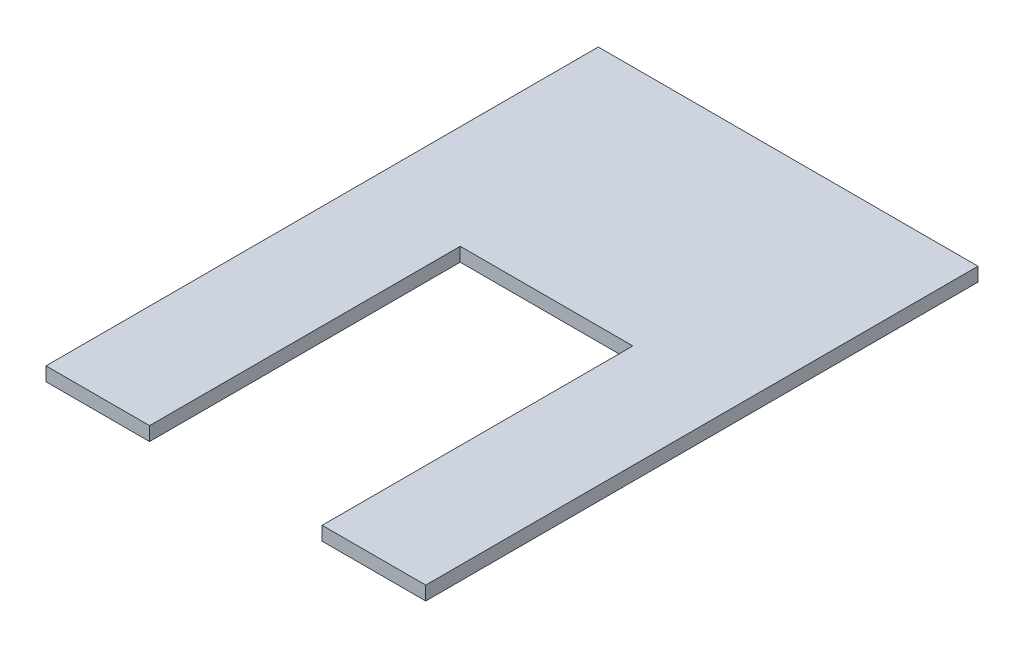
ISO-10303-21;
HEADER;
FILE_DESCRIPTION(('STEP AP214'),'2;1');
FILE_NAME('part.step','',(''),(''),'','','');
FILE_SCHEMA(('AUTOMOTIVE_DESIGN { 1 0 10303 214 1 1 1 1 }'));
ENDSEC;
DATA;
#1=APPLICATION_CONTEXT('core data for automotive mechanical design processes');
#2=APPLICATION_PROTOCOL_DEFINITION('international standard','automotive_design',2000,#1);
#3=PRODUCT_CONTEXT('',#1,'mechanical');
#4=PRODUCT('Part','Part','',(#3));
#5=PRODUCT_RELATED_PRODUCT_CATEGORY('part','',(#4));
#6=PRODUCT_DEFINITION_FORMATION('','',#4);
#7=PRODUCT_DEFINITION_CONTEXT('part definition',#1,'design');
#8=PRODUCT_DEFINITION('design','',#6,#7);
#9=PRODUCT_DEFINITION_SHAPE('','',#8);
#10=(LENGTH_UNIT() NAMED_UNIT(*) SI_UNIT(.MILLI.,.METRE.));
#11=(NAMED_UNIT(*) PLANE_ANGLE_UNIT() SI_UNIT($,.RADIAN.));
#12=(NAMED_UNIT(*) SI_UNIT($,.STERADIAN.) SOLID_ANGLE_UNIT());
#13=UNCERTAINTY_MEASURE_WITH_UNIT(LENGTH_MEASURE(1.E-05),#10,'distance_accuracy_value','');
#14=(GEOMETRIC_REPRESENTATION_CONTEXT(3) GLOBAL_UNCERTAINTY_ASSIGNED_CONTEXT((#13)) GLOBAL_UNIT_ASSIGNED_CONTEXT((#10,
#11,#12)) REPRESENTATION_CONTEXT('',''));
#15=CARTESIAN_POINT('',(0.,0.,0.));
#16=DIRECTION('',(0.,0.,1.));
#17=DIRECTION('',(1.,0.,0.));
#18=AXIS2_PLACEMENT_3D('',#15,#16,#17);
#19=CARTESIAN_POINT('',(0.,2.54,0.));
#20=DIRECTION('',(0.,0.,-1.));
#21=DIRECTION('',(-1.,0.,0.));
#22=AXIS2_PLACEMENT_3D('',#19,#20,#21);
#23=PLANE('',#22);
#24=DIRECTION('',(1.,0.,0.));
#25=VECTOR('',#24,1.);
#26=CARTESIAN_POINT('',(0.,0.,0.));
#27=LINE('',#26,#25);
#28=CARTESIAN_POINT('',(0.,0.,0.));
#29=VERTEX_POINT('',#28);
#30=CARTESIAN_POINT('',(19.05,0.,0.));
#31=VERTEX_POINT('',#30);
#32=EDGE_CURVE('E120',#29,#31,#27,.T.);
#33=ORIENTED_EDGE('',*,*,#32,.T.);
#34=DIRECTION('',(0.,1.,0.));
#35=VECTOR('',#34,1.);
#36=CARTESIAN_POINT('',(19.05,0.,0.));
#37=LINE('',#36,#35);
#38=CARTESIAN_POINT('',(19.05,2.54,0.));
#39=VERTEX_POINT('',#38);
#40=EDGE_CURVE('E108',#31,#39,#37,.T.);
#41=ORIENTED_EDGE('',*,*,#40,.T.);
#42=DIRECTION('',(1.,0.,0.));
#43=VECTOR('',#42,1.);
#44=CARTESIAN_POINT('',(0.,2.54,0.));
#45=LINE('',#44,#43);
#46=CARTESIAN_POINT('',(0.,2.54,0.));
#47=VERTEX_POINT('',#46);
#48=EDGE_CURVE('E86',#47,#39,#45,.T.);
#49=ORIENTED_EDGE('',*,*,#48,.F.);
#50=DIRECTION('',(0.,-1.,0.));
#51=VECTOR('',#50,1.);
#52=CARTESIAN_POINT('',(0.,2.54,0.));
#53=LINE('',#52,#51);
#54=EDGE_CURVE('E11',#47,#29,#53,.T.);
#55=ORIENTED_EDGE('',*,*,#54,.T.);
#56=EDGE_LOOP('',(#33,#41,#49,#55));
#57=FACE_BOUND('',#56,.T.);
#58=ADVANCED_FACE('F34',(#57),#23,.F.);
#59=CARTESIAN_POINT('',(0.,2.54,0.));
#60=DIRECTION('',(1.,0.,0.));
#61=DIRECTION('',(0.,0.,-1.));
#62=AXIS2_PLACEMENT_3D('',#59,#60,#61);
#63=PLANE('',#62);
#64=DIRECTION('',(0.,0.,1.));
#65=VECTOR('',#64,1.);
#66=CARTESIAN_POINT('',(0.,0.,0.));
#67=LINE('',#66,#65);
#68=CARTESIAN_POINT('',(0.,0.,-101.6));
#69=VERTEX_POINT('',#68);
#70=EDGE_CURVE('E131',#69,#29,#67,.T.);
#71=ORIENTED_EDGE('',*,*,#70,.T.);
#72=ORIENTED_EDGE('',*,*,#54,.F.);
#73=DIRECTION('',(0.,0.,1.));
#74=VECTOR('',#73,1.);
#75=CARTESIAN_POINT('',(0.,2.54,0.));
#76=LINE('',#75,#74);
#77=CARTESIAN_POINT('',(0.,2.54,-101.6));
#78=VERTEX_POINT('',#77);
#79=EDGE_CURVE('E136',#78,#47,#76,.T.);
#80=ORIENTED_EDGE('',*,*,#79,.F.);
#81=DIRECTION('',(0.,-1.,0.));
#82=VECTOR('',#81,1.);
#83=CARTESIAN_POINT('',(0.,2.54,-101.6));
#84=LINE('',#83,#82);
#85=EDGE_CURVE('E137',#78,#69,#84,.T.);
#86=ORIENTED_EDGE('',*,*,#85,.T.);
#87=EDGE_LOOP('',(#71,#72,#80,#86));
#88=FACE_BOUND('',#87,.T.);
#89=ADVANCED_FACE('F36',(#88),#63,.F.);
#90=CARTESIAN_POINT('',(50.8,2.54,0.));
#91=VERTEX_POINT('',#90);
#92=CARTESIAN_POINT('',(69.85,2.54,0.));
#93=VERTEX_POINT('',#92);
#94=EDGE_CURVE('E162',#91,#93,#45,.T.);
#95=ORIENTED_EDGE('',*,*,#94,.F.);
#96=DIRECTION('',(0.,1.,0.));
#97=VECTOR('',#96,1.);
#98=CARTESIAN_POINT('',(50.8,0.,0.));
#99=LINE('',#98,#97);
#100=CARTESIAN_POINT('',(50.8,0.,0.));
#101=VERTEX_POINT('',#100);
#102=EDGE_CURVE('E115',#101,#91,#99,.T.);
#103=ORIENTED_EDGE('',*,*,#102,.F.);
#104=CARTESIAN_POINT('',(69.85,0.,0.));
#105=VERTEX_POINT('',#104);
#106=EDGE_CURVE('E128',#101,#105,#27,.T.);
#107=ORIENTED_EDGE('',*,*,#106,.T.);
#108=DIRECTION('',(0.,-1.,0.));
#109=VECTOR('',#108,1.);
#110=CARTESIAN_POINT('',(69.85,2.54,0.));
#111=LINE('',#110,#109);
#112=EDGE_CURVE('E42',#93,#105,#111,.T.);
#113=ORIENTED_EDGE('',*,*,#112,.F.);
#114=EDGE_LOOP('',(#95,#103,#107,#113));
#115=FACE_BOUND('',#114,.T.);
#116=ADVANCED_FACE('F177',(#115),#23,.F.);
#117=CARTESIAN_POINT('',(69.85,2.54,0.));
#118=DIRECTION('',(-1.,0.,0.));
#119=DIRECTION('',(0.,0.,1.));
#120=AXIS2_PLACEMENT_3D('',#117,#118,#119);
#121=PLANE('',#120);
#122=DIRECTION('',(0.,0.,-1.));
#123=VECTOR('',#122,1.);
#124=CARTESIAN_POINT('',(69.85,0.,0.));
#125=LINE('',#124,#123);
#126=CARTESIAN_POINT('',(69.85,0.,-101.6));
#127=VERTEX_POINT('',#126);
#128=EDGE_CURVE('E127',#105,#127,#125,.T.);
#129=ORIENTED_EDGE('',*,*,#128,.T.);
#130=DIRECTION('',(0.,-1.,0.));
#131=VECTOR('',#130,1.);
#132=CARTESIAN_POINT('',(69.85,2.54,-101.6));
#133=LINE('',#132,#131);
#134=CARTESIAN_POINT('',(69.85,2.54,-101.6));
#135=VERTEX_POINT('',#134);
#136=EDGE_CURVE('E139',#135,#127,#133,.T.);
#137=ORIENTED_EDGE('',*,*,#136,.F.);
#138=DIRECTION('',(0.,0.,-1.));
#139=VECTOR('',#138,1.);
#140=CARTESIAN_POINT('',(69.85,2.54,0.));
#141=LINE('',#140,#139);
#142=EDGE_CURVE('E147',#93,#135,#141,.T.);
#143=ORIENTED_EDGE('',*,*,#142,.F.);
#144=ORIENTED_EDGE('',*,*,#112,.T.);
#145=EDGE_LOOP('',(#129,#137,#143,#144));
#146=FACE_BOUND('',#145,.T.);
#147=ADVANCED_FACE('F145',(#146),#121,.F.);
#148=CARTESIAN_POINT('',(0.,2.54,-101.6));
#149=DIRECTION('',(0.,0.,1.));
#150=DIRECTION('',(1.,0.,0.));
#151=AXIS2_PLACEMENT_3D('',#148,#149,#150);
#152=PLANE('',#151);
#153=DIRECTION('',(-1.,0.,0.));
#154=VECTOR('',#153,1.);
#155=CARTESIAN_POINT('',(0.,0.,-101.6));
#156=LINE('',#155,#154);
#157=EDGE_CURVE('E79',#127,#69,#156,.T.);
#158=ORIENTED_EDGE('',*,*,#157,.T.);
#159=ORIENTED_EDGE('',*,*,#85,.F.);
#160=DIRECTION('',(-1.,0.,0.));
#161=VECTOR('',#160,1.);
#162=CARTESIAN_POINT('',(0.,2.54,-101.6));
#163=LINE('',#162,#161);
#164=EDGE_CURVE('E58',#135,#78,#163,.T.);
#165=ORIENTED_EDGE('',*,*,#164,.F.);
#166=ORIENTED_EDGE('',*,*,#136,.T.);
#167=EDGE_LOOP('',(#158,#159,#165,#166));
#168=FACE_BOUND('',#167,.T.);
#169=ADVANCED_FACE('F166',(#168),#152,.F.);
#170=CARTESIAN_POINT('',(0.,2.54,0.));
#171=DIRECTION('',(0.,-1.,0.));
#172=DIRECTION('',(0.,0.,-1.));
#173=AXIS2_PLACEMENT_3D('',#170,#171,#172);
#174=PLANE('',#173);
#175=ORIENTED_EDGE('',*,*,#48,.T.);
#176=DIRECTION('',(0.,0.,1.));
#177=VECTOR('',#176,1.);
#178=CARTESIAN_POINT('',(19.05,2.54,0.));
#179=LINE('',#178,#177);
#180=CARTESIAN_POINT('',(19.05,2.54,-57.15));
#181=VERTEX_POINT('',#180);
#182=EDGE_CURVE('E113',#181,#39,#179,.T.);
#183=ORIENTED_EDGE('',*,*,#182,.F.);
#184=DIRECTION('',(-1.,0.,0.));
#185=VECTOR('',#184,1.);
#186=CARTESIAN_POINT('',(19.05,2.54,-57.15));
#187=LINE('',#186,#185);
#188=CARTESIAN_POINT('',(50.8,2.54,-57.15));
#189=VERTEX_POINT('',#188);
#190=EDGE_CURVE('E123',#189,#181,#187,.T.);
#191=ORIENTED_EDGE('',*,*,#190,.F.);
#192=DIRECTION('',(0.,0.,-1.));
#193=VECTOR('',#192,1.);
#194=CARTESIAN_POINT('',(50.8,2.54,0.));
#195=LINE('',#194,#193);
#196=EDGE_CURVE('E169',#91,#189,#195,.T.);
#197=ORIENTED_EDGE('',*,*,#196,.F.);
#198=ORIENTED_EDGE('',*,*,#94,.T.);
#199=ORIENTED_EDGE('',*,*,#142,.T.);
#200=ORIENTED_EDGE('',*,*,#164,.T.);
#201=ORIENTED_EDGE('',*,*,#79,.T.);
#202=EDGE_LOOP('',(#175,#183,#191,#197,#198,#199,#200,#201));
#203=FACE_BOUND('',#202,.T.);
#204=ADVANCED_FACE('F164',(#203),#174,.F.);
#205=CARTESIAN_POINT('',(0.,0.,0.));
#206=DIRECTION('',(0.,-1.,0.));
#207=DIRECTION('',(0.,0.,-1.));
#208=AXIS2_PLACEMENT_3D('',#205,#206,#207);
#209=PLANE('',#208);
#210=DIRECTION('',(0.,0.,1.));
#211=VECTOR('',#210,1.);
#212=CARTESIAN_POINT('',(19.05,0.,0.));
#213=LINE('',#212,#211);
#214=CARTESIAN_POINT('',(19.05,0.,-57.15));
#215=VERTEX_POINT('',#214);
#216=EDGE_CURVE('E111',#215,#31,#213,.T.);
#217=ORIENTED_EDGE('',*,*,#216,.T.);
#218=ORIENTED_EDGE('',*,*,#32,.F.);
#219=ORIENTED_EDGE('',*,*,#70,.F.);
#220=ORIENTED_EDGE('',*,*,#157,.F.);
#221=ORIENTED_EDGE('',*,*,#128,.F.);
#222=ORIENTED_EDGE('',*,*,#106,.F.);
#223=DIRECTION('',(0.,0.,-1.));
#224=VECTOR('',#223,1.);
#225=CARTESIAN_POINT('',(50.8,0.,0.));
#226=LINE('',#225,#224);
#227=CARTESIAN_POINT('',(50.8,0.,-57.15));
#228=VERTEX_POINT('',#227);
#229=EDGE_CURVE('E122',#101,#228,#226,.T.);
#230=ORIENTED_EDGE('',*,*,#229,.T.);
#231=DIRECTION('',(-1.,0.,0.));
#232=VECTOR('',#231,1.);
#233=CARTESIAN_POINT('',(19.05,0.,-57.15));
#234=LINE('',#233,#232);
#235=EDGE_CURVE('E49',#228,#215,#234,.T.);
#236=ORIENTED_EDGE('',*,*,#235,.T.);
#237=EDGE_LOOP('',(#217,#218,#219,#220,#221,#222,#230,#236));
#238=FACE_BOUND('',#237,.T.);
#239=ADVANCED_FACE('F118',(#238),#209,.T.);
#240=CARTESIAN_POINT('',(19.05,0.,0.));
#241=DIRECTION('',(-1.,0.,0.));
#242=DIRECTION('',(0.,0.,1.));
#243=AXIS2_PLACEMENT_3D('',#240,#241,#242);
#244=PLANE('',#243);
#245=ORIENTED_EDGE('',*,*,#182,.T.);
#246=ORIENTED_EDGE('',*,*,#40,.F.);
#247=ORIENTED_EDGE('',*,*,#216,.F.);
#248=DIRECTION('',(0.,1.,0.));
#249=VECTOR('',#248,1.);
#250=CARTESIAN_POINT('',(19.05,0.,-57.15));
#251=LINE('',#250,#249);
#252=EDGE_CURVE('E152',#215,#181,#251,.T.);
#253=ORIENTED_EDGE('',*,*,#252,.T.);
#254=EDGE_LOOP('',(#245,#246,#247,#253));
#255=FACE_BOUND('',#254,.T.);
#256=ADVANCED_FACE('F110',(#255),#244,.F.);
#257=CARTESIAN_POINT('',(19.05,0.,-57.15));
#258=DIRECTION('',(0.,0.,-1.));
#259=DIRECTION('',(-1.,0.,0.));
#260=AXIS2_PLACEMENT_3D('',#257,#258,#259);
#261=PLANE('',#260);
#262=ORIENTED_EDGE('',*,*,#190,.T.);
#263=ORIENTED_EDGE('',*,*,#252,.F.);
#264=ORIENTED_EDGE('',*,*,#235,.F.);
#265=DIRECTION('',(0.,1.,0.));
#266=VECTOR('',#265,1.);
#267=CARTESIAN_POINT('',(50.8,0.,-57.15));
#268=LINE('',#267,#266);
#269=EDGE_CURVE('E153',#228,#189,#268,.T.);
#270=ORIENTED_EDGE('',*,*,#269,.T.);
#271=EDGE_LOOP('',(#262,#263,#264,#270));
#272=FACE_BOUND('',#271,.T.);
#273=ADVANCED_FACE('F226',(#272),#261,.F.);
#274=CARTESIAN_POINT('',(50.8,0.,0.));
#275=DIRECTION('',(1.,0.,0.));
#276=DIRECTION('',(0.,0.,-1.));
#277=AXIS2_PLACEMENT_3D('',#274,#275,#276);
#278=PLANE('',#277);
#279=ORIENTED_EDGE('',*,*,#196,.T.);
#280=ORIENTED_EDGE('',*,*,#269,.F.);
#281=ORIENTED_EDGE('',*,*,#229,.F.);
#282=ORIENTED_EDGE('',*,*,#102,.T.);
#283=EDGE_LOOP('',(#279,#280,#281,#282));
#284=FACE_BOUND('',#283,.T.);
#285=ADVANCED_FACE('F176',(#284),#278,.F.);
#286=CLOSED_SHELL('',(#58,#89,#116,#147,#169,#204,#239,#256,#273,#285));
#287=MANIFOLD_SOLID_BREP('B2',#286);
#288=ADVANCED_BREP_SHAPE_REPRESENTATION('',(#18,#287),#14);
#289=SHAPE_DEFINITION_REPRESENTATION(#9,#288);
ENDSEC;
END-ISO-10303-21;
